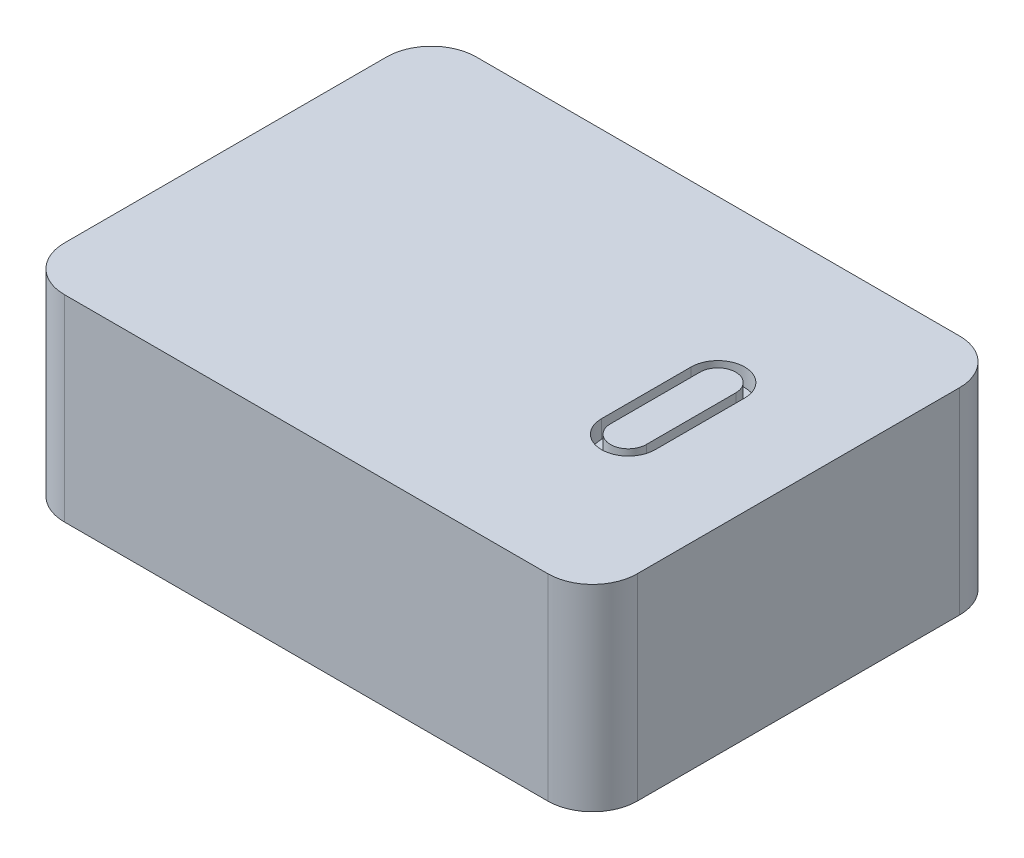
ISO-10303-21;
HEADER;
FILE_DESCRIPTION(('STEP AP214'),'2;1');
FILE_NAME('part.step','',(''),(''),'','','');
FILE_SCHEMA(('AUTOMOTIVE_DESIGN { 1 0 10303 214 1 1 1 1 }'));
ENDSEC;
DATA;
#1=APPLICATION_CONTEXT('core data for automotive mechanical design processes');
#2=APPLICATION_PROTOCOL_DEFINITION('international standard','automotive_design',2000,#1);
#3=PRODUCT_CONTEXT('',#1,'mechanical');
#4=PRODUCT('Part','Part','',(#3));
#5=PRODUCT_RELATED_PRODUCT_CATEGORY('part','',(#4));
#6=PRODUCT_DEFINITION_FORMATION('','',#4);
#7=PRODUCT_DEFINITION_CONTEXT('part definition',#1,'design');
#8=PRODUCT_DEFINITION('design','',#6,#7);
#9=PRODUCT_DEFINITION_SHAPE('','',#8);
#10=(LENGTH_UNIT() NAMED_UNIT(*) SI_UNIT(.MILLI.,.METRE.));
#11=(NAMED_UNIT(*) PLANE_ANGLE_UNIT() SI_UNIT($,.RADIAN.));
#12=(NAMED_UNIT(*) SI_UNIT($,.STERADIAN.) SOLID_ANGLE_UNIT());
#13=UNCERTAINTY_MEASURE_WITH_UNIT(LENGTH_MEASURE(1.E-05),#10,'distance_accuracy_value','');
#14=(GEOMETRIC_REPRESENTATION_CONTEXT(3) GLOBAL_UNCERTAINTY_ASSIGNED_CONTEXT((#13)) GLOBAL_UNIT_ASSIGNED_CONTEXT((#10,
#11,#12)) REPRESENTATION_CONTEXT('',''));
#15=CARTESIAN_POINT('',(0.,0.,0.));
#16=DIRECTION('',(0.,0.,1.));
#17=DIRECTION('',(1.,0.,0.));
#18=AXIS2_PLACEMENT_3D('',#15,#16,#17);
#19=CARTESIAN_POINT('',(32.,22.,23.));
#20=DIRECTION('',(-1.,0.,0.));
#21=DIRECTION('',(0.,0.,1.));
#22=AXIS2_PLACEMENT_3D('',#19,#20,#21);
#23=PLANE('',#22);
#24=DIRECTION('',(0.,0.,-1.));
#25=VECTOR('',#24,1.);
#26=CARTESIAN_POINT('',(32.,0.,23.));
#27=LINE('',#26,#25);
#28=CARTESIAN_POINT('',(32.,0.,18.));
#29=VERTEX_POINT('',#28);
#30=CARTESIAN_POINT('',(32.,0.,-18.));
#31=VERTEX_POINT('',#30);
#32=EDGE_CURVE('E212',#29,#31,#27,.T.);
#33=ORIENTED_EDGE('',*,*,#32,.T.);
#34=DIRECTION('',(0.,-1.,0.));
#35=VECTOR('',#34,1.);
#36=CARTESIAN_POINT('',(32.,22.,-18.));
#37=LINE('',#36,#35);
#38=CARTESIAN_POINT('',(32.,22.,-18.));
#39=VERTEX_POINT('',#38);
#40=EDGE_CURVE('E11',#31,#39,#37,.F.);
#41=ORIENTED_EDGE('',*,*,#40,.T.);
#42=DIRECTION('',(0.,0.,-1.));
#43=VECTOR('',#42,1.);
#44=CARTESIAN_POINT('',(32.,22.,23.));
#45=LINE('',#44,#43);
#46=CARTESIAN_POINT('',(32.,22.,18.));
#47=VERTEX_POINT('',#46);
#48=EDGE_CURVE('E218',#47,#39,#45,.T.);
#49=ORIENTED_EDGE('',*,*,#48,.F.);
#50=DIRECTION('',(0.,-1.,0.));
#51=VECTOR('',#50,1.);
#52=CARTESIAN_POINT('',(32.,22.,18.));
#53=LINE('',#52,#51);
#54=EDGE_CURVE('E42',#47,#29,#53,.T.);
#55=ORIENTED_EDGE('',*,*,#54,.T.);
#56=EDGE_LOOP('',(#33,#41,#49,#55));
#57=FACE_BOUND('',#56,.T.);
#58=ADVANCED_FACE('F34',(#57),#23,.F.);
#59=CARTESIAN_POINT('',(-32.,22.,-23.));
#60=DIRECTION('',(0.,0.,1.));
#61=DIRECTION('',(1.,0.,0.));
#62=AXIS2_PLACEMENT_3D('',#59,#60,#61);
#63=PLANE('',#62);
#64=DIRECTION('',(-1.,0.,0.));
#65=VECTOR('',#64,1.);
#66=CARTESIAN_POINT('',(-32.,0.,-23.));
#67=LINE('',#66,#65);
#68=CARTESIAN_POINT('',(27.,0.,-23.));
#69=VERTEX_POINT('',#68);
#70=CARTESIAN_POINT('',(-27.,0.,-23.));
#71=VERTEX_POINT('',#70);
#72=EDGE_CURVE('E234',#69,#71,#67,.T.);
#73=ORIENTED_EDGE('',*,*,#72,.T.);
#74=DIRECTION('',(0.,-1.,0.));
#75=VECTOR('',#74,1.);
#76=CARTESIAN_POINT('',(-27.,22.,-23.));
#77=LINE('',#76,#75);
#78=CARTESIAN_POINT('',(-27.,22.,-23.));
#79=VERTEX_POINT('',#78);
#80=EDGE_CURVE('E257',#71,#79,#77,.F.);
#81=ORIENTED_EDGE('',*,*,#80,.T.);
#82=DIRECTION('',(-1.,0.,0.));
#83=VECTOR('',#82,1.);
#84=CARTESIAN_POINT('',(-32.,22.,-23.));
#85=LINE('',#84,#83);
#86=CARTESIAN_POINT('',(27.,22.,-23.));
#87=VERTEX_POINT('',#86);
#88=EDGE_CURVE('E221',#87,#79,#85,.T.);
#89=ORIENTED_EDGE('',*,*,#88,.F.);
#90=DIRECTION('',(0.,-1.,0.));
#91=VECTOR('',#90,1.);
#92=CARTESIAN_POINT('',(27.,22.,-23.));
#93=LINE('',#92,#91);
#94=EDGE_CURVE('E254',#87,#69,#93,.T.);
#95=ORIENTED_EDGE('',*,*,#94,.T.);
#96=EDGE_LOOP('',(#73,#81,#89,#95));
#97=FACE_BOUND('',#96,.T.);
#98=ADVANCED_FACE('F290',(#97),#63,.F.);
#99=CARTESIAN_POINT('',(-32.,22.,23.));
#100=DIRECTION('',(1.,0.,0.));
#101=DIRECTION('',(0.,0.,-1.));
#102=AXIS2_PLACEMENT_3D('',#99,#100,#101);
#103=PLANE('',#102);
#104=DIRECTION('',(0.,0.,1.));
#105=VECTOR('',#104,1.);
#106=CARTESIAN_POINT('',(-32.,22.,23.));
#107=LINE('',#106,#105);
#108=CARTESIAN_POINT('',(-32.,22.,-18.));
#109=VERTEX_POINT('',#108);
#110=CARTESIAN_POINT('',(-32.,22.,18.));
#111=VERTEX_POINT('',#110);
#112=EDGE_CURVE('E225',#109,#111,#107,.T.);
#113=ORIENTED_EDGE('',*,*,#112,.F.);
#114=DIRECTION('',(0.,-1.,0.));
#115=VECTOR('',#114,1.);
#116=CARTESIAN_POINT('',(-32.,22.,-18.));
#117=LINE('',#116,#115);
#118=CARTESIAN_POINT('',(-32.,0.,-18.));
#119=VERTEX_POINT('',#118);
#120=EDGE_CURVE('E243',#109,#119,#117,.T.);
#121=ORIENTED_EDGE('',*,*,#120,.T.);
#122=DIRECTION('',(0.,0.,1.));
#123=VECTOR('',#122,1.);
#124=CARTESIAN_POINT('',(-32.,0.,23.));
#125=LINE('',#124,#123);
#126=CARTESIAN_POINT('',(-32.,0.,18.));
#127=VERTEX_POINT('',#126);
#128=EDGE_CURVE('E237',#119,#127,#125,.T.);
#129=ORIENTED_EDGE('',*,*,#128,.T.);
#130=DIRECTION('',(0.,-1.,0.));
#131=VECTOR('',#130,1.);
#132=CARTESIAN_POINT('',(-32.,22.,18.));
#133=LINE('',#132,#131);
#134=EDGE_CURVE('E231',#127,#111,#133,.F.);
#135=ORIENTED_EDGE('',*,*,#134,.T.);
#136=EDGE_LOOP('',(#113,#121,#129,#135));
#137=FACE_BOUND('',#136,.T.);
#138=ADVANCED_FACE('F300',(#137),#103,.F.);
#139=CARTESIAN_POINT('',(-32.,22.,23.));
#140=DIRECTION('',(0.,0.,-1.));
#141=DIRECTION('',(-1.,0.,0.));
#142=AXIS2_PLACEMENT_3D('',#139,#140,#141);
#143=PLANE('',#142);
#144=DIRECTION('',(1.,0.,0.));
#145=VECTOR('',#144,1.);
#146=CARTESIAN_POINT('',(-32.,22.,23.));
#147=LINE('',#146,#145);
#148=CARTESIAN_POINT('',(-27.,22.,23.));
#149=VERTEX_POINT('',#148);
#150=CARTESIAN_POINT('',(27.,22.,23.));
#151=VERTEX_POINT('',#150);
#152=EDGE_CURVE('E228',#149,#151,#147,.T.);
#153=ORIENTED_EDGE('',*,*,#152,.F.);
#154=DIRECTION('',(0.,-1.,0.));
#155=VECTOR('',#154,1.);
#156=CARTESIAN_POINT('',(-27.,22.,23.));
#157=LINE('',#156,#155);
#158=CARTESIAN_POINT('',(-27.,0.,23.));
#159=VERTEX_POINT('',#158);
#160=EDGE_CURVE('E269',#149,#159,#157,.T.);
#161=ORIENTED_EDGE('',*,*,#160,.T.);
#162=DIRECTION('',(1.,0.,0.));
#163=VECTOR('',#162,1.);
#164=CARTESIAN_POINT('',(-32.,0.,23.));
#165=LINE('',#164,#163);
#166=CARTESIAN_POINT('',(27.,0.,23.));
#167=VERTEX_POINT('',#166);
#168=EDGE_CURVE('E222',#159,#167,#165,.T.);
#169=ORIENTED_EDGE('',*,*,#168,.T.);
#170=DIRECTION('',(0.,-1.,0.));
#171=VECTOR('',#170,1.);
#172=CARTESIAN_POINT('',(27.,22.,23.));
#173=LINE('',#172,#171);
#174=EDGE_CURVE('E267',#167,#151,#173,.F.);
#175=ORIENTED_EDGE('',*,*,#174,.T.);
#176=EDGE_LOOP('',(#153,#161,#169,#175));
#177=FACE_BOUND('',#176,.T.);
#178=ADVANCED_FACE('F308',(#177),#143,.F.);
#179=CARTESIAN_POINT('',(0.,22.,0.));
#180=DIRECTION('',(0.,-1.,0.));
#181=DIRECTION('',(0.,0.,-1.));
#182=AXIS2_PLACEMENT_3D('',#179,#180,#181);
#183=PLANE('',#182);
#184=DIRECTION('',(0.,0.,-1.));
#185=VECTOR('',#184,1.);
#186=CARTESIAN_POINT('',(21.,22.,5.));
#187=LINE('',#186,#185);
#188=CARTESIAN_POINT('',(21.,22.,5.));
#189=VERTEX_POINT('',#188);
#190=CARTESIAN_POINT('',(21.,22.,-5.));
#191=VERTEX_POINT('',#190);
#192=EDGE_CURVE('E202',#189,#191,#187,.T.);
#193=ORIENTED_EDGE('',*,*,#192,.F.);
#194=CARTESIAN_POINT('',(18.,22.,5.));
#195=DIRECTION('',(0.,1.,0.));
#196=DIRECTION('',(0.,0.,1.));
#197=AXIS2_PLACEMENT_3D('',#194,#195,#196);
#198=CIRCLE('',#197,3.);
#199=CARTESIAN_POINT('',(15.,22.,5.));
#200=VERTEX_POINT('',#199);
#201=EDGE_CURVE('E49',#200,#189,#198,.T.);
#202=ORIENTED_EDGE('',*,*,#201,.F.);
#203=DIRECTION('',(0.,0.,1.));
#204=VECTOR('',#203,1.);
#205=CARTESIAN_POINT('',(15.,22.,5.));
#206=LINE('',#205,#204);
#207=CARTESIAN_POINT('',(15.,22.,-5.));
#208=VERTEX_POINT('',#207);
#209=EDGE_CURVE('E191',#208,#200,#206,.T.);
#210=ORIENTED_EDGE('',*,*,#209,.F.);
#211=CARTESIAN_POINT('',(18.,22.,-5.));
#212=DIRECTION('',(0.,1.,0.));
#213=DIRECTION('',(0.,0.,1.));
#214=AXIS2_PLACEMENT_3D('',#211,#212,#213);
#215=CIRCLE('',#214,3.);
#216=EDGE_CURVE('E205',#191,#208,#215,.T.);
#217=ORIENTED_EDGE('',*,*,#216,.F.);
#218=EDGE_LOOP('',(#193,#202,#210,#217));
#219=FACE_BOUND('',#218,.T.);
#220=ORIENTED_EDGE('',*,*,#88,.T.);
#221=CARTESIAN_POINT('',(-27.,22.,-18.));
#222=DIRECTION('',(0.,-1.,0.));
#223=DIRECTION('',(0.,0.,-1.));
#224=AXIS2_PLACEMENT_3D('',#221,#222,#223);
#225=CIRCLE('',#224,5.);
#226=EDGE_CURVE('E265',#79,#109,#225,.F.);
#227=ORIENTED_EDGE('',*,*,#226,.T.);
#228=ORIENTED_EDGE('',*,*,#112,.T.);
#229=CARTESIAN_POINT('',(-27.,22.,18.));
#230=DIRECTION('',(0.,-1.,0.));
#231=DIRECTION('',(0.,0.,-1.));
#232=AXIS2_PLACEMENT_3D('',#229,#230,#231);
#233=CIRCLE('',#232,5.);
#234=EDGE_CURVE('E263',#111,#149,#233,.F.);
#235=ORIENTED_EDGE('',*,*,#234,.T.);
#236=ORIENTED_EDGE('',*,*,#152,.T.);
#237=CARTESIAN_POINT('',(27.,22.,18.));
#238=DIRECTION('',(0.,-1.,0.));
#239=DIRECTION('',(0.,0.,-1.));
#240=AXIS2_PLACEMENT_3D('',#237,#238,#239);
#241=CIRCLE('',#240,5.);
#242=EDGE_CURVE('E259',#151,#47,#241,.F.);
#243=ORIENTED_EDGE('',*,*,#242,.T.);
#244=ORIENTED_EDGE('',*,*,#48,.T.);
#245=CARTESIAN_POINT('',(27.,22.,-18.));
#246=DIRECTION('',(0.,-1.,0.));
#247=DIRECTION('',(0.,0.,-1.));
#248=AXIS2_PLACEMENT_3D('',#245,#246,#247);
#249=CIRCLE('',#248,5.);
#250=EDGE_CURVE('E261',#39,#87,#249,.F.);
#251=ORIENTED_EDGE('',*,*,#250,.T.);
#252=EDGE_LOOP('',(#220,#227,#228,#235,#236,#243,#244,#251));
#253=FACE_BOUND('',#252,.T.);
#254=ADVANCED_FACE('F294',(#219,#253),#183,.F.);
#255=CARTESIAN_POINT('',(0.,0.,0.));
#256=DIRECTION('',(0.,-1.,0.));
#257=DIRECTION('',(0.,0.,-1.));
#258=AXIS2_PLACEMENT_3D('',#255,#256,#257);
#259=PLANE('',#258);
#260=ORIENTED_EDGE('',*,*,#128,.F.);
#261=CARTESIAN_POINT('',(-27.,0.,-18.));
#262=DIRECTION('',(0.,-1.,0.));
#263=DIRECTION('',(0.,0.,-1.));
#264=AXIS2_PLACEMENT_3D('',#261,#262,#263);
#265=CIRCLE('',#264,5.);
#266=EDGE_CURVE('E252',#119,#71,#265,.T.);
#267=ORIENTED_EDGE('',*,*,#266,.T.);
#268=ORIENTED_EDGE('',*,*,#72,.F.);
#269=CARTESIAN_POINT('',(27.,0.,-18.));
#270=DIRECTION('',(0.,-1.,0.));
#271=DIRECTION('',(0.,0.,-1.));
#272=AXIS2_PLACEMENT_3D('',#269,#270,#271);
#273=CIRCLE('',#272,5.);
#274=EDGE_CURVE('E248',#69,#31,#273,.T.);
#275=ORIENTED_EDGE('',*,*,#274,.T.);
#276=ORIENTED_EDGE('',*,*,#32,.F.);
#277=CARTESIAN_POINT('',(27.,0.,18.));
#278=DIRECTION('',(0.,-1.,0.));
#279=DIRECTION('',(0.,0.,-1.));
#280=AXIS2_PLACEMENT_3D('',#277,#278,#279);
#281=CIRCLE('',#280,5.);
#282=EDGE_CURVE('E246',#29,#167,#281,.T.);
#283=ORIENTED_EDGE('',*,*,#282,.T.);
#284=ORIENTED_EDGE('',*,*,#168,.F.);
#285=CARTESIAN_POINT('',(-27.,0.,18.));
#286=DIRECTION('',(0.,-1.,0.));
#287=DIRECTION('',(0.,0.,-1.));
#288=AXIS2_PLACEMENT_3D('',#285,#286,#287);
#289=CIRCLE('',#288,5.);
#290=EDGE_CURVE('E250',#159,#127,#289,.T.);
#291=ORIENTED_EDGE('',*,*,#290,.T.);
#292=EDGE_LOOP('',(#260,#267,#268,#275,#276,#283,#284,#291));
#293=FACE_BOUND('',#292,.T.);
#294=ADVANCED_FACE('F281',(#293),#259,.T.);
#295=CARTESIAN_POINT('',(-27.,22.,-18.));
#296=DIRECTION('',(0.,-1.,0.));
#297=DIRECTION('',(0.,0.,-1.));
#298=AXIS2_PLACEMENT_3D('',#295,#296,#297);
#299=CYLINDRICAL_SURFACE('',#298,5.);
#300=ORIENTED_EDGE('',*,*,#226,.F.);
#301=ORIENTED_EDGE('',*,*,#80,.F.);
#302=ORIENTED_EDGE('',*,*,#266,.F.);
#303=ORIENTED_EDGE('',*,*,#120,.F.);
#304=EDGE_LOOP('',(#300,#301,#302,#303));
#305=FACE_BOUND('',#304,.T.);
#306=ADVANCED_FACE('F298',(#305),#299,.T.);
#307=CARTESIAN_POINT('',(-27.,22.,18.));
#308=DIRECTION('',(0.,-1.,0.));
#309=DIRECTION('',(0.,0.,-1.));
#310=AXIS2_PLACEMENT_3D('',#307,#308,#309);
#311=CYLINDRICAL_SURFACE('',#310,5.);
#312=ORIENTED_EDGE('',*,*,#234,.F.);
#313=ORIENTED_EDGE('',*,*,#134,.F.);
#314=ORIENTED_EDGE('',*,*,#290,.F.);
#315=ORIENTED_EDGE('',*,*,#160,.F.);
#316=EDGE_LOOP('',(#312,#313,#314,#315));
#317=FACE_BOUND('',#316,.T.);
#318=ADVANCED_FACE('F305',(#317),#311,.T.);
#319=CARTESIAN_POINT('',(27.,22.,-18.));
#320=DIRECTION('',(0.,-1.,0.));
#321=DIRECTION('',(0.,0.,-1.));
#322=AXIS2_PLACEMENT_3D('',#319,#320,#321);
#323=CYLINDRICAL_SURFACE('',#322,5.);
#324=ORIENTED_EDGE('',*,*,#250,.F.);
#325=ORIENTED_EDGE('',*,*,#40,.F.);
#326=ORIENTED_EDGE('',*,*,#274,.F.);
#327=ORIENTED_EDGE('',*,*,#94,.F.);
#328=EDGE_LOOP('',(#324,#325,#326,#327));
#329=FACE_BOUND('',#328,.T.);
#330=ADVANCED_FACE('F287',(#329),#323,.T.);
#331=CARTESIAN_POINT('',(27.,22.,18.));
#332=DIRECTION('',(0.,-1.,0.));
#333=DIRECTION('',(0.,0.,-1.));
#334=AXIS2_PLACEMENT_3D('',#331,#332,#333);
#335=CYLINDRICAL_SURFACE('',#334,5.);
#336=ORIENTED_EDGE('',*,*,#242,.F.);
#337=ORIENTED_EDGE('',*,*,#174,.F.);
#338=ORIENTED_EDGE('',*,*,#282,.F.);
#339=ORIENTED_EDGE('',*,*,#54,.F.);
#340=EDGE_LOOP('',(#336,#337,#338,#339));
#341=FACE_BOUND('',#340,.T.);
#342=ADVANCED_FACE('F36',(#341),#335,.T.);
#343=CARTESIAN_POINT('',(18.,20.,5.));
#344=DIRECTION('',(0.,1.,0.));
#345=DIRECTION('',(0.,0.,1.));
#346=AXIS2_PLACEMENT_3D('',#343,#344,#345);
#347=CYLINDRICAL_SURFACE('',#346,3.);
#348=ORIENTED_EDGE('',*,*,#201,.T.);
#349=DIRECTION('',(0.,1.,0.));
#350=VECTOR('',#349,1.);
#351=CARTESIAN_POINT('',(21.,20.,5.));
#352=LINE('',#351,#350);
#353=CARTESIAN_POINT('',(21.,20.,5.));
#354=VERTEX_POINT('',#353);
#355=EDGE_CURVE('E200',#354,#189,#352,.T.);
#356=ORIENTED_EDGE('',*,*,#355,.F.);
#357=CARTESIAN_POINT('',(18.,20.,5.));
#358=DIRECTION('',(0.,1.,0.));
#359=DIRECTION('',(0.,0.,1.));
#360=AXIS2_PLACEMENT_3D('',#357,#358,#359);
#361=CIRCLE('',#360,3.);
#362=CARTESIAN_POINT('',(15.,20.,5.));
#363=VERTEX_POINT('',#362);
#364=EDGE_CURVE('E187',#363,#354,#361,.T.);
#365=ORIENTED_EDGE('',*,*,#364,.F.);
#366=DIRECTION('',(0.,1.,0.));
#367=VECTOR('',#366,1.);
#368=CARTESIAN_POINT('',(15.,20.,5.));
#369=LINE('',#368,#367);
#370=EDGE_CURVE('E210',#363,#200,#369,.T.);
#371=ORIENTED_EDGE('',*,*,#370,.T.);
#372=EDGE_LOOP('',(#348,#356,#365,#371));
#373=FACE_BOUND('',#372,.T.);
#374=ADVANCED_FACE('F311',(#373),#347,.F.);
#375=CARTESIAN_POINT('',(15.,20.,5.));
#376=DIRECTION('',(-1.,0.,0.));
#377=DIRECTION('',(0.,0.,1.));
#378=AXIS2_PLACEMENT_3D('',#375,#376,#377);
#379=PLANE('',#378);
#380=ORIENTED_EDGE('',*,*,#209,.T.);
#381=ORIENTED_EDGE('',*,*,#370,.F.);
#382=DIRECTION('',(0.,0.,1.));
#383=VECTOR('',#382,1.);
#384=CARTESIAN_POINT('',(15.,20.,5.));
#385=LINE('',#384,#383);
#386=CARTESIAN_POINT('',(15.,20.,-5.));
#387=VERTEX_POINT('',#386);
#388=EDGE_CURVE('E197',#387,#363,#385,.T.);
#389=ORIENTED_EDGE('',*,*,#388,.F.);
#390=DIRECTION('',(0.,1.,0.));
#391=VECTOR('',#390,1.);
#392=CARTESIAN_POINT('',(15.,20.,-5.));
#393=LINE('',#392,#391);
#394=EDGE_CURVE('E213',#387,#208,#393,.T.);
#395=ORIENTED_EDGE('',*,*,#394,.T.);
#396=EDGE_LOOP('',(#380,#381,#389,#395));
#397=FACE_BOUND('',#396,.T.);
#398=ADVANCED_FACE('F316',(#397),#379,.F.);
#399=CARTESIAN_POINT('',(18.,20.,-5.));
#400=DIRECTION('',(0.,1.,0.));
#401=DIRECTION('',(0.,0.,1.));
#402=AXIS2_PLACEMENT_3D('',#399,#400,#401);
#403=CYLINDRICAL_SURFACE('',#402,3.);
#404=ORIENTED_EDGE('',*,*,#216,.T.);
#405=ORIENTED_EDGE('',*,*,#394,.F.);
#406=CARTESIAN_POINT('',(18.,20.,-5.));
#407=DIRECTION('',(0.,1.,0.));
#408=DIRECTION('',(0.,0.,1.));
#409=AXIS2_PLACEMENT_3D('',#406,#407,#408);
#410=CIRCLE('',#409,3.);
#411=CARTESIAN_POINT('',(21.,20.,-5.));
#412=VERTEX_POINT('',#411);
#413=EDGE_CURVE('E194',#412,#387,#410,.T.);
#414=ORIENTED_EDGE('',*,*,#413,.F.);
#415=DIRECTION('',(0.,1.,0.));
#416=VECTOR('',#415,1.);
#417=CARTESIAN_POINT('',(21.,20.,-5.));
#418=LINE('',#417,#416);
#419=EDGE_CURVE('E215',#412,#191,#418,.T.);
#420=ORIENTED_EDGE('',*,*,#419,.T.);
#421=EDGE_LOOP('',(#404,#405,#414,#420));
#422=FACE_BOUND('',#421,.T.);
#423=ADVANCED_FACE('F371',(#422),#403,.F.);
#424=CARTESIAN_POINT('',(21.,20.,5.));
#425=DIRECTION('',(1.,0.,0.));
#426=DIRECTION('',(0.,0.,-1.));
#427=AXIS2_PLACEMENT_3D('',#424,#425,#426);
#428=PLANE('',#427);
#429=ORIENTED_EDGE('',*,*,#192,.T.);
#430=ORIENTED_EDGE('',*,*,#419,.F.);
#431=DIRECTION('',(0.,0.,-1.));
#432=VECTOR('',#431,1.);
#433=CARTESIAN_POINT('',(21.,20.,5.));
#434=LINE('',#433,#432);
#435=EDGE_CURVE('E190',#354,#412,#434,.T.);
#436=ORIENTED_EDGE('',*,*,#435,.F.);
#437=ORIENTED_EDGE('',*,*,#355,.T.);
#438=EDGE_LOOP('',(#429,#430,#436,#437));
#439=FACE_BOUND('',#438,.T.);
#440=ADVANCED_FACE('F381',(#439),#428,.F.);
#441=CARTESIAN_POINT('',(18.,20.,5.));
#442=DIRECTION('',(0.,1.,0.));
#443=DIRECTION('',(0.,0.,1.));
#444=AXIS2_PLACEMENT_3D('',#441,#442,#443);
#445=PLANE('',#444);
#446=DIRECTION('',(0.,0.,1.));
#447=VECTOR('',#446,1.);
#448=CARTESIAN_POINT('',(16.,20.,5.));
#449=LINE('',#448,#447);
#450=CARTESIAN_POINT('',(16.,20.,-5.));
#451=VERTEX_POINT('',#450);
#452=CARTESIAN_POINT('',(16.,20.,5.));
#453=VERTEX_POINT('',#452);
#454=EDGE_CURVE('E158',#451,#453,#449,.T.);
#455=ORIENTED_EDGE('',*,*,#454,.F.);
#456=CARTESIAN_POINT('',(18.,20.,-5.));
#457=DIRECTION('',(0.,1.,0.));
#458=DIRECTION('',(0.,0.,1.));
#459=AXIS2_PLACEMENT_3D('',#456,#457,#458);
#460=CIRCLE('',#459,2.);
#461=CARTESIAN_POINT('',(20.,20.,-5.));
#462=VERTEX_POINT('',#461);
#463=EDGE_CURVE('E168',#462,#451,#460,.T.);
#464=ORIENTED_EDGE('',*,*,#463,.F.);
#465=DIRECTION('',(0.,0.,-1.));
#466=VECTOR('',#465,1.);
#467=CARTESIAN_POINT('',(20.,20.,5.));
#468=LINE('',#467,#466);
#469=CARTESIAN_POINT('',(20.,20.,5.));
#470=VERTEX_POINT('',#469);
#471=EDGE_CURVE('E150',#470,#462,#468,.T.);
#472=ORIENTED_EDGE('',*,*,#471,.F.);
#473=CARTESIAN_POINT('',(18.,20.,5.));
#474=DIRECTION('',(0.,1.,0.));
#475=DIRECTION('',(0.,0.,1.));
#476=AXIS2_PLACEMENT_3D('',#473,#474,#475);
#477=CIRCLE('',#476,2.);
#478=EDGE_CURVE('E165',#453,#470,#477,.T.);
#479=ORIENTED_EDGE('',*,*,#478,.F.);
#480=EDGE_LOOP('',(#455,#464,#472,#479));
#481=FACE_BOUND('',#480,.T.);
#482=ORIENTED_EDGE('',*,*,#364,.T.);
#483=ORIENTED_EDGE('',*,*,#435,.T.);
#484=ORIENTED_EDGE('',*,*,#413,.T.);
#485=ORIENTED_EDGE('',*,*,#388,.T.);
#486=EDGE_LOOP('',(#482,#483,#484,#485));
#487=FACE_BOUND('',#486,.T.);
#488=ADVANCED_FACE('F163',(#481,#487),#445,.T.);
#489=CARTESIAN_POINT('',(18.,20.,5.));
#490=DIRECTION('',(0.,1.,0.));
#491=DIRECTION('',(0.,0.,1.));
#492=AXIS2_PLACEMENT_3D('',#489,#490,#491);
#493=CYLINDRICAL_SURFACE('',#492,2.);
#494=CARTESIAN_POINT('',(18.,22.,5.));
#495=DIRECTION('',(0.,1.,0.));
#496=DIRECTION('',(0.,0.,1.));
#497=AXIS2_PLACEMENT_3D('',#494,#495,#496);
#498=CIRCLE('',#497,2.);
#499=CARTESIAN_POINT('',(16.,22.,5.));
#500=VERTEX_POINT('',#499);
#501=CARTESIAN_POINT('',(20.,22.,5.));
#502=VERTEX_POINT('',#501);
#503=EDGE_CURVE('E179',#500,#502,#498,.T.);
#504=ORIENTED_EDGE('',*,*,#503,.F.);
#505=DIRECTION('',(0.,1.,0.));
#506=VECTOR('',#505,1.);
#507=CARTESIAN_POINT('',(16.,20.,5.));
#508=LINE('',#507,#506);
#509=EDGE_CURVE('E171',#453,#500,#508,.T.);
#510=ORIENTED_EDGE('',*,*,#509,.F.);
#511=ORIENTED_EDGE('',*,*,#478,.T.);
#512=DIRECTION('',(0.,1.,0.));
#513=VECTOR('',#512,1.);
#514=CARTESIAN_POINT('',(20.,20.,5.));
#515=LINE('',#514,#513);
#516=EDGE_CURVE('E147',#470,#502,#515,.T.);
#517=ORIENTED_EDGE('',*,*,#516,.T.);
#518=EDGE_LOOP('',(#504,#510,#511,#517));
#519=FACE_BOUND('',#518,.T.);
#520=ADVANCED_FACE('F170',(#519),#493,.T.);
#521=CARTESIAN_POINT('',(16.,20.,5.));
#522=DIRECTION('',(-1.,0.,0.));
#523=DIRECTION('',(0.,0.,1.));
#524=AXIS2_PLACEMENT_3D('',#521,#522,#523);
#525=PLANE('',#524);
#526=DIRECTION('',(0.,0.,1.));
#527=VECTOR('',#526,1.);
#528=CARTESIAN_POINT('',(16.,22.,5.));
#529=LINE('',#528,#527);
#530=CARTESIAN_POINT('',(16.,22.,-5.));
#531=VERTEX_POINT('',#530);
#532=EDGE_CURVE('E172',#531,#500,#529,.T.);
#533=ORIENTED_EDGE('',*,*,#532,.F.);
#534=DIRECTION('',(0.,1.,0.));
#535=VECTOR('',#534,1.);
#536=CARTESIAN_POINT('',(16.,20.,-5.));
#537=LINE('',#536,#535);
#538=EDGE_CURVE('E184',#451,#531,#537,.T.);
#539=ORIENTED_EDGE('',*,*,#538,.F.);
#540=ORIENTED_EDGE('',*,*,#454,.T.);
#541=ORIENTED_EDGE('',*,*,#509,.T.);
#542=EDGE_LOOP('',(#533,#539,#540,#541));
#543=FACE_BOUND('',#542,.T.);
#544=ADVANCED_FACE('F408',(#543),#525,.T.);
#545=CARTESIAN_POINT('',(18.,20.,-5.));
#546=DIRECTION('',(0.,1.,0.));
#547=DIRECTION('',(0.,0.,1.));
#548=AXIS2_PLACEMENT_3D('',#545,#546,#547);
#549=CYLINDRICAL_SURFACE('',#548,2.);
#550=CARTESIAN_POINT('',(18.,22.,-5.));
#551=DIRECTION('',(0.,1.,0.));
#552=DIRECTION('',(0.,0.,1.));
#553=AXIS2_PLACEMENT_3D('',#550,#551,#552);
#554=CIRCLE('',#553,2.);
#555=CARTESIAN_POINT('',(20.,22.,-5.));
#556=VERTEX_POINT('',#555);
#557=EDGE_CURVE('E57',#556,#531,#554,.T.);
#558=ORIENTED_EDGE('',*,*,#557,.F.);
#559=DIRECTION('',(0.,1.,0.));
#560=VECTOR('',#559,1.);
#561=CARTESIAN_POINT('',(20.,20.,-5.));
#562=LINE('',#561,#560);
#563=EDGE_CURVE('E157',#462,#556,#562,.T.);
#564=ORIENTED_EDGE('',*,*,#563,.F.);
#565=ORIENTED_EDGE('',*,*,#463,.T.);
#566=ORIENTED_EDGE('',*,*,#538,.T.);
#567=EDGE_LOOP('',(#558,#564,#565,#566));
#568=FACE_BOUND('',#567,.T.);
#569=ADVANCED_FACE('F417',(#568),#549,.T.);
#570=CARTESIAN_POINT('',(20.,20.,5.));
#571=DIRECTION('',(1.,0.,0.));
#572=DIRECTION('',(0.,0.,-1.));
#573=AXIS2_PLACEMENT_3D('',#570,#571,#572);
#574=PLANE('',#573);
#575=DIRECTION('',(0.,0.,-1.));
#576=VECTOR('',#575,1.);
#577=CARTESIAN_POINT('',(20.,22.,5.));
#578=LINE('',#577,#576);
#579=EDGE_CURVE('E152',#502,#556,#578,.T.);
#580=ORIENTED_EDGE('',*,*,#579,.F.);
#581=ORIENTED_EDGE('',*,*,#516,.F.);
#582=ORIENTED_EDGE('',*,*,#471,.T.);
#583=ORIENTED_EDGE('',*,*,#563,.T.);
#584=EDGE_LOOP('',(#580,#581,#582,#583));
#585=FACE_BOUND('',#584,.T.);
#586=ADVANCED_FACE('F149',(#585),#574,.T.);
#587=ORIENTED_EDGE('',*,*,#503,.T.);
#588=ORIENTED_EDGE('',*,*,#579,.T.);
#589=ORIENTED_EDGE('',*,*,#557,.T.);
#590=ORIENTED_EDGE('',*,*,#532,.T.);
#591=EDGE_LOOP('',(#587,#588,#589,#590));
#592=FACE_BOUND('',#591,.T.);
#593=ADVANCED_FACE('F354',(#592),#183,.F.);
#594=CLOSED_SHELL('',(#58,#98,#138,#178,#254,#294,#306,#318,#330,#342,#374,#398,#423,#440,#488,
#520,#544,#569,#586,#593));
#595=MANIFOLD_SOLID_BREP('B2',#594);
#596=ADVANCED_BREP_SHAPE_REPRESENTATION('',(#18,#595),#14);
#597=SHAPE_DEFINITION_REPRESENTATION(#9,#596);
ENDSEC;
END-ISO-10303-21;
